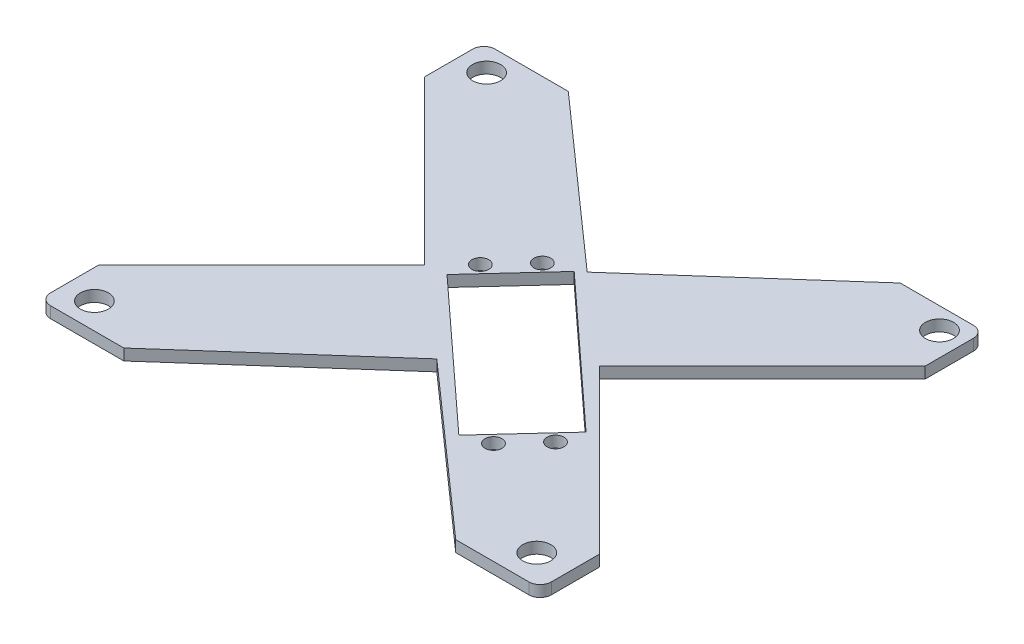
ISO-10303-21;
HEADER;
FILE_DESCRIPTION(('STEP AP214'),'2;1');
FILE_NAME('part.step','',(''),(''),'','','');
FILE_SCHEMA(('AUTOMOTIVE_DESIGN { 1 0 10303 214 1 1 1 1 }'));
ENDSEC;
DATA;
#1=APPLICATION_CONTEXT('core data for automotive mechanical design processes');
#2=APPLICATION_PROTOCOL_DEFINITION('international standard','automotive_design',2000,#1);
#3=PRODUCT_CONTEXT('',#1,'mechanical');
#4=PRODUCT('Part','Part','',(#3));
#5=PRODUCT_RELATED_PRODUCT_CATEGORY('part','',(#4));
#6=PRODUCT_DEFINITION_FORMATION('','',#4);
#7=PRODUCT_DEFINITION_CONTEXT('part definition',#1,'design');
#8=PRODUCT_DEFINITION('design','',#6,#7);
#9=PRODUCT_DEFINITION_SHAPE('','',#8);
#10=(LENGTH_UNIT() NAMED_UNIT(*) SI_UNIT(.MILLI.,.METRE.));
#11=(NAMED_UNIT(*) PLANE_ANGLE_UNIT() SI_UNIT($,.RADIAN.));
#12=(NAMED_UNIT(*) SI_UNIT($,.STERADIAN.) SOLID_ANGLE_UNIT());
#13=UNCERTAINTY_MEASURE_WITH_UNIT(LENGTH_MEASURE(1.E-05),#10,'distance_accuracy_value','');
#14=(GEOMETRIC_REPRESENTATION_CONTEXT(3) GLOBAL_UNCERTAINTY_ASSIGNED_CONTEXT((#13)) GLOBAL_UNIT_ASSIGNED_CONTEXT((#10,
#11,#12)) REPRESENTATION_CONTEXT('',''));
#15=CARTESIAN_POINT('',(0.,0.,0.));
#16=DIRECTION('',(0.,0.,1.));
#17=DIRECTION('',(1.,0.,0.));
#18=AXIS2_PLACEMENT_3D('',#15,#16,#17);
#19=CARTESIAN_POINT('',(56.515,2.54,-50.165));
#20=DIRECTION('',(-1.,0.,0.));
#21=DIRECTION('',(0.,0.,1.));
#22=AXIS2_PLACEMENT_3D('',#19,#20,#21);
#23=PLANE('',#22);
#24=DIRECTION('',(0.,0.,-1.));
#25=VECTOR('',#24,1.);
#26=CARTESIAN_POINT('',(56.515,2.54,-50.165));
#27=LINE('',#26,#25);
#28=CARTESIAN_POINT('',(56.515,2.54,-36.7210512242138));
#29=VERTEX_POINT('',#28);
#30=CARTESIAN_POINT('',(56.515,2.54,-47.625));
#31=VERTEX_POINT('',#30);
#32=EDGE_CURVE('E342',#29,#31,#27,.T.);
#33=ORIENTED_EDGE('',*,*,#32,.F.);
#34=DIRECTION('',(0.,1.,0.));
#35=VECTOR('',#34,1.);
#36=CARTESIAN_POINT('',(56.515,0.,-36.7210512242138));
#37=LINE('',#36,#35);
#38=CARTESIAN_POINT('',(56.515,0.,-36.7210512242138));
#39=VERTEX_POINT('',#38);
#40=EDGE_CURVE('E263',#39,#29,#37,.T.);
#41=ORIENTED_EDGE('',*,*,#40,.F.);
#42=DIRECTION('',(0.,0.,-1.));
#43=VECTOR('',#42,1.);
#44=CARTESIAN_POINT('',(56.515,0.,-50.165));
#45=LINE('',#44,#43);
#46=CARTESIAN_POINT('',(56.515,0.,-47.625));
#47=VERTEX_POINT('',#46);
#48=EDGE_CURVE('E334',#39,#47,#45,.T.);
#49=ORIENTED_EDGE('',*,*,#48,.T.);
#50=DIRECTION('',(0.,-1.,0.));
#51=VECTOR('',#50,1.);
#52=CARTESIAN_POINT('',(56.515,2.54,-47.625));
#53=LINE('',#52,#51);
#54=EDGE_CURVE('E395',#47,#31,#53,.F.);
#55=ORIENTED_EDGE('',*,*,#54,.T.);
#56=EDGE_LOOP('',(#33,#41,#49,#55));
#57=FACE_BOUND('',#56,.T.);
#58=ADVANCED_FACE('F39',(#57),#23,.F.);
#59=CARTESIAN_POINT('',(-56.515,2.54,-50.165));
#60=DIRECTION('',(0.,0.,1.));
#61=DIRECTION('',(1.,0.,0.));
#62=AXIS2_PLACEMENT_3D('',#59,#60,#61);
#63=PLANE('',#62);
#64=DIRECTION('',(-1.,0.,0.));
#65=VECTOR('',#64,1.);
#66=CARTESIAN_POINT('',(-56.515,0.,-50.165));
#67=LINE('',#66,#65);
#68=CARTESIAN_POINT('',(53.975,0.,-50.165));
#69=VERTEX_POINT('',#68);
#70=CARTESIAN_POINT('',(37.461428175192,0.,-50.165));
#71=VERTEX_POINT('',#70);
#72=EDGE_CURVE('E359',#69,#71,#67,.T.);
#73=ORIENTED_EDGE('',*,*,#72,.T.);
#74=DIRECTION('',(0.,1.,0.));
#75=VECTOR('',#74,1.);
#76=CARTESIAN_POINT('',(37.461428175192,0.,-50.165));
#77=LINE('',#76,#75);
#78=CARTESIAN_POINT('',(37.461428175192,2.54,-50.165));
#79=VERTEX_POINT('',#78);
#80=EDGE_CURVE('E331',#71,#79,#77,.T.);
#81=ORIENTED_EDGE('',*,*,#80,.T.);
#82=DIRECTION('',(-1.,0.,0.));
#83=VECTOR('',#82,1.);
#84=CARTESIAN_POINT('',(-56.515,2.54,-50.165));
#85=LINE('',#84,#83);
#86=CARTESIAN_POINT('',(53.975,2.54,-50.165));
#87=VERTEX_POINT('',#86);
#88=EDGE_CURVE('E343',#87,#79,#85,.T.);
#89=ORIENTED_EDGE('',*,*,#88,.F.);
#90=DIRECTION('',(0.,-1.,0.));
#91=VECTOR('',#90,1.);
#92=CARTESIAN_POINT('',(53.975,2.54,-50.165));
#93=LINE('',#92,#91);
#94=EDGE_CURVE('E380',#87,#69,#93,.T.);
#95=ORIENTED_EDGE('',*,*,#94,.T.);
#96=EDGE_LOOP('',(#73,#81,#89,#95));
#97=FACE_BOUND('',#96,.T.);
#98=ADVANCED_FACE('F436',(#97),#63,.F.);
#99=CARTESIAN_POINT('',(-56.515,2.54,-50.165));
#100=DIRECTION('',(1.,0.,0.));
#101=DIRECTION('',(0.,0.,-1.));
#102=AXIS2_PLACEMENT_3D('',#99,#100,#101);
#103=PLANE('',#102);
#104=DIRECTION('',(0.,0.,1.));
#105=VECTOR('',#104,1.);
#106=CARTESIAN_POINT('',(-56.515,0.,-50.165));
#107=LINE('',#106,#105);
#108=CARTESIAN_POINT('',(-56.515,0.,-47.625));
#109=VERTEX_POINT('',#108);
#110=CARTESIAN_POINT('',(-56.515,0.,-36.7210512242138));
#111=VERTEX_POINT('',#110);
#112=EDGE_CURVE('E363',#109,#111,#107,.T.);
#113=ORIENTED_EDGE('',*,*,#112,.T.);
#114=DIRECTION('',(0.,1.,0.));
#115=VECTOR('',#114,1.);
#116=CARTESIAN_POINT('',(-56.515,0.,-36.7210512242138));
#117=LINE('',#116,#115);
#118=CARTESIAN_POINT('',(-56.515,2.54,-36.7210512242138));
#119=VERTEX_POINT('',#118);
#120=EDGE_CURVE('E279',#111,#119,#117,.T.);
#121=ORIENTED_EDGE('',*,*,#120,.T.);
#122=DIRECTION('',(0.,0.,1.));
#123=VECTOR('',#122,1.);
#124=CARTESIAN_POINT('',(-56.515,2.54,-50.165));
#125=LINE('',#124,#123);
#126=CARTESIAN_POINT('',(-56.515,2.54,-47.625));
#127=VERTEX_POINT('',#126);
#128=EDGE_CURVE('E347',#127,#119,#125,.T.);
#129=ORIENTED_EDGE('',*,*,#128,.F.);
#130=DIRECTION('',(0.,-1.,0.));
#131=VECTOR('',#130,1.);
#132=CARTESIAN_POINT('',(-56.515,2.54,-47.625));
#133=LINE('',#132,#131);
#134=EDGE_CURVE('E354',#127,#109,#133,.T.);
#135=ORIENTED_EDGE('',*,*,#134,.T.);
#136=EDGE_LOOP('',(#113,#121,#129,#135));
#137=FACE_BOUND('',#136,.T.);
#138=ADVANCED_FACE('F444',(#137),#103,.F.);
#139=CARTESIAN_POINT('',(-56.515,2.54,50.165));
#140=DIRECTION('',(0.,0.,-1.));
#141=DIRECTION('',(-1.,0.,0.));
#142=AXIS2_PLACEMENT_3D('',#139,#140,#141);
#143=PLANE('',#142);
#144=DIRECTION('',(1.,0.,0.));
#145=VECTOR('',#144,1.);
#146=CARTESIAN_POINT('',(-56.515,0.,50.165));
#147=LINE('',#146,#145);
#148=CARTESIAN_POINT('',(-53.975,0.,50.165));
#149=VERTEX_POINT('',#148);
#150=CARTESIAN_POINT('',(-37.4614281751919,0.,50.165));
#151=VERTEX_POINT('',#150);
#152=EDGE_CURVE('E367',#149,#151,#147,.T.);
#153=ORIENTED_EDGE('',*,*,#152,.T.);
#154=DIRECTION('',(0.,1.,0.));
#155=VECTOR('',#154,1.);
#156=CARTESIAN_POINT('',(-37.4614281751919,0.,50.165));
#157=LINE('',#156,#155);
#158=CARTESIAN_POINT('',(-37.4614281751919,2.54,50.165));
#159=VERTEX_POINT('',#158);
#160=EDGE_CURVE('E302',#151,#159,#157,.T.);
#161=ORIENTED_EDGE('',*,*,#160,.T.);
#162=DIRECTION('',(1.,0.,0.));
#163=VECTOR('',#162,1.);
#164=CARTESIAN_POINT('',(-56.515,2.54,50.165));
#165=LINE('',#164,#163);
#166=CARTESIAN_POINT('',(-53.975,2.54,50.165));
#167=VERTEX_POINT('',#166);
#168=EDGE_CURVE('E351',#167,#159,#165,.T.);
#169=ORIENTED_EDGE('',*,*,#168,.F.);
#170=DIRECTION('',(0.,-1.,0.));
#171=VECTOR('',#170,1.);
#172=CARTESIAN_POINT('',(-53.975,2.54,50.165));
#173=LINE('',#172,#171);
#174=EDGE_CURVE('E404',#167,#149,#173,.T.);
#175=ORIENTED_EDGE('',*,*,#174,.T.);
#176=EDGE_LOOP('',(#153,#161,#169,#175));
#177=FACE_BOUND('',#176,.T.);
#178=ADVANCED_FACE('F451',(#177),#143,.F.);
#179=CARTESIAN_POINT('',(56.515,0.,47.625));
#180=VERTEX_POINT('',#179);
#181=CARTESIAN_POINT('',(56.515,0.,36.7428597041662));
#182=VERTEX_POINT('',#181);
#183=EDGE_CURVE('E355',#180,#182,#45,.T.);
#184=ORIENTED_EDGE('',*,*,#183,.T.);
#185=DIRECTION('',(0.,1.,0.));
#186=VECTOR('',#185,1.);
#187=CARTESIAN_POINT('',(56.515,0.,36.7428597041662));
#188=LINE('',#187,#186);
#189=CARTESIAN_POINT('',(56.515,2.54,36.7428597041662));
#190=VERTEX_POINT('',#189);
#191=EDGE_CURVE('E269',#182,#190,#188,.T.);
#192=ORIENTED_EDGE('',*,*,#191,.T.);
#193=CARTESIAN_POINT('',(56.515,2.54,47.625));
#194=VERTEX_POINT('',#193);
#195=EDGE_CURVE('E338',#194,#190,#27,.T.);
#196=ORIENTED_EDGE('',*,*,#195,.F.);
#197=DIRECTION('',(0.,-1.,0.));
#198=VECTOR('',#197,1.);
#199=CARTESIAN_POINT('',(56.515,2.54,47.625));
#200=LINE('',#199,#198);
#201=EDGE_CURVE('E392',#194,#180,#200,.T.);
#202=ORIENTED_EDGE('',*,*,#201,.T.);
#203=EDGE_LOOP('',(#184,#192,#196,#202));
#204=FACE_BOUND('',#203,.T.);
#205=ADVANCED_FACE('F439',(#204),#23,.F.);
#206=CARTESIAN_POINT('',(-37.4614281751919,2.54,-50.165));
#207=VERTEX_POINT('',#206);
#208=CARTESIAN_POINT('',(-53.975,2.54,-50.165));
#209=VERTEX_POINT('',#208);
#210=EDGE_CURVE('E341',#207,#209,#85,.T.);
#211=ORIENTED_EDGE('',*,*,#210,.F.);
#212=DIRECTION('',(0.,1.,0.));
#213=VECTOR('',#212,1.);
#214=CARTESIAN_POINT('',(-37.4614281751919,0.,-50.165));
#215=LINE('',#214,#213);
#216=CARTESIAN_POINT('',(-37.4614281751919,0.,-50.165));
#217=VERTEX_POINT('',#216);
#218=EDGE_CURVE('E327',#217,#207,#215,.T.);
#219=ORIENTED_EDGE('',*,*,#218,.F.);
#220=CARTESIAN_POINT('',(-53.975,0.,-50.165));
#221=VERTEX_POINT('',#220);
#222=EDGE_CURVE('E358',#217,#221,#67,.T.);
#223=ORIENTED_EDGE('',*,*,#222,.T.);
#224=DIRECTION('',(0.,-1.,0.));
#225=VECTOR('',#224,1.);
#226=CARTESIAN_POINT('',(-53.975,2.54,-50.165));
#227=LINE('',#226,#225);
#228=EDGE_CURVE('E375',#221,#209,#227,.F.);
#229=ORIENTED_EDGE('',*,*,#228,.T.);
#230=EDGE_LOOP('',(#211,#219,#223,#229));
#231=FACE_BOUND('',#230,.T.);
#232=ADVANCED_FACE('F447',(#231),#63,.F.);
#233=CARTESIAN_POINT('',(-56.515,2.54,36.7428597041663));
#234=VERTEX_POINT('',#233);
#235=CARTESIAN_POINT('',(-56.515,2.54,47.625));
#236=VERTEX_POINT('',#235);
#237=EDGE_CURVE('E346',#234,#236,#125,.T.);
#238=ORIENTED_EDGE('',*,*,#237,.F.);
#239=DIRECTION('',(0.,1.,0.));
#240=VECTOR('',#239,1.);
#241=CARTESIAN_POINT('',(-56.515,0.,36.7428597041663));
#242=LINE('',#241,#240);
#243=CARTESIAN_POINT('',(-56.515,0.,36.7428597041663));
#244=VERTEX_POINT('',#243);
#245=EDGE_CURVE('E284',#244,#234,#242,.T.);
#246=ORIENTED_EDGE('',*,*,#245,.F.);
#247=CARTESIAN_POINT('',(-56.515,0.,47.625));
#248=VERTEX_POINT('',#247);
#249=EDGE_CURVE('E362',#244,#248,#107,.T.);
#250=ORIENTED_EDGE('',*,*,#249,.T.);
#251=DIRECTION('',(0.,-1.,0.));
#252=VECTOR('',#251,1.);
#253=CARTESIAN_POINT('',(-56.515,2.54,47.625));
#254=LINE('',#253,#252);
#255=EDGE_CURVE('E11',#248,#236,#254,.F.);
#256=ORIENTED_EDGE('',*,*,#255,.T.);
#257=EDGE_LOOP('',(#238,#246,#250,#256));
#258=FACE_BOUND('',#257,.T.);
#259=ADVANCED_FACE('F457',(#258),#103,.F.);
#260=CARTESIAN_POINT('',(37.461428175192,2.54,50.165));
#261=VERTEX_POINT('',#260);
#262=CARTESIAN_POINT('',(53.975,2.54,50.165));
#263=VERTEX_POINT('',#262);
#264=EDGE_CURVE('E350',#261,#263,#165,.T.);
#265=ORIENTED_EDGE('',*,*,#264,.F.);
#266=DIRECTION('',(0.,1.,0.));
#267=VECTOR('',#266,1.);
#268=CARTESIAN_POINT('',(37.461428175192,0.,50.165));
#269=LINE('',#268,#267);
#270=CARTESIAN_POINT('',(37.461428175192,0.,50.165));
#271=VERTEX_POINT('',#270);
#272=EDGE_CURVE('E306',#271,#261,#269,.T.);
#273=ORIENTED_EDGE('',*,*,#272,.F.);
#274=CARTESIAN_POINT('',(53.975,0.,50.165));
#275=VERTEX_POINT('',#274);
#276=EDGE_CURVE('E366',#271,#275,#147,.T.);
#277=ORIENTED_EDGE('',*,*,#276,.T.);
#278=DIRECTION('',(0.,-1.,0.));
#279=VECTOR('',#278,1.);
#280=CARTESIAN_POINT('',(53.975,2.54,50.165));
#281=LINE('',#280,#279);
#282=EDGE_CURVE('E48',#275,#263,#281,.F.);
#283=ORIENTED_EDGE('',*,*,#282,.T.);
#284=EDGE_LOOP('',(#265,#273,#277,#283));
#285=FACE_BOUND('',#284,.T.);
#286=ADVANCED_FACE('F461',(#285),#143,.F.);
#287=CARTESIAN_POINT('',(0.,2.54,0.));
#288=DIRECTION('',(0.,1.,0.));
#289=DIRECTION('',(0.,0.,1.));
#290=AXIS2_PLACEMENT_3D('',#287,#288,#289);
#291=PLANE('',#290);
#292=CARTESIAN_POINT('',(22.9384426615327,2.54,27.1142567001944));
#293=DIRECTION('',(0.,1.,0.));
#294=DIRECTION('',(0.,0.,1.));
#295=AXIS2_PLACEMENT_3D('',#292,#293,#294);
#296=CIRCLE('',#295,1.905);
#297=CARTESIAN_POINT('',(22.9384426615327,2.54,29.0192567001944));
#298=VERTEX_POINT('',#297);
#299=EDGE_CURVE('E413',#298,#298,#296,.T.);
#300=ORIENTED_EDGE('',*,*,#299,.F.);
#301=EDGE_LOOP('',(#300));
#302=FACE_BOUND('',#301,.T.);
#303=CARTESIAN_POINT('',(29.632724367509,2.54,19.8125152338707));
#304=DIRECTION('',(0.,1.,0.));
#305=DIRECTION('',(0.,0.,-1.));
#306=AXIS2_PLACEMENT_3D('',#303,#304,#305);
#307=CIRCLE('',#306,1.905);
#308=CARTESIAN_POINT('',(29.632724367509,2.54,17.9075152338707));
#309=VERTEX_POINT('',#308);
#310=EDGE_CURVE('E789',#309,#309,#307,.T.);
#311=ORIENTED_EDGE('',*,*,#310,.F.);
#312=EDGE_LOOP('',(#311));
#313=FACE_BOUND('',#312,.T.);
#314=CARTESIAN_POINT('',(-13.5418827123031,2.54,-6.38808292883855));
#315=DIRECTION('',(0.,1.,0.));
#316=DIRECTION('',(0.,0.,-1.));
#317=AXIS2_PLACEMENT_3D('',#314,#315,#316);
#318=CIRCLE('',#317,1.905);
#319=CARTESIAN_POINT('',(-13.5418827123031,2.54,-8.29308292883855));
#320=VERTEX_POINT('',#319);
#321=EDGE_CURVE('E782',#320,#320,#318,.T.);
#322=ORIENTED_EDGE('',*,*,#321,.F.);
#323=EDGE_LOOP('',(#322));
#324=FACE_BOUND('',#323,.T.);
#325=CARTESIAN_POINT('',(-6.83523337993968,2.54,-13.6784663709292));
#326=DIRECTION('',(0.,1.,0.));
#327=DIRECTION('',(0.,0.,1.));
#328=AXIS2_PLACEMENT_3D('',#325,#326,#327);
#329=CIRCLE('',#328,1.90500000000001);
#330=CARTESIAN_POINT('',(-6.83523337993968,2.54,-11.7734663709292));
#331=VERTEX_POINT('',#330);
#332=EDGE_CURVE('E226',#331,#331,#329,.T.);
#333=ORIENTED_EDGE('',*,*,#332,.F.);
#334=EDGE_LOOP('',(#333));
#335=FACE_BOUND('',#334,.T.);
#336=DIRECTION('',(-0.67640499957668,0.,0.736529888427939));
#337=VECTOR('',#336,1.);
#338=CARTESIAN_POINT('',(-1.59845597878194,2.54,-15.6380008972203));
#339=LINE('',#338,#337);
#340=CARTESIAN_POINT('',(-1.59845597878194,2.54,-15.6380008972203));
#341=VERTEX_POINT('',#340);
#342=CARTESIAN_POINT('',(-15.3430055701801,2.54,-0.671713564364595));
#343=VERTEX_POINT('',#342);
#344=EDGE_CURVE('E56',#341,#343,#339,.T.);
#345=ORIENTED_EDGE('',*,*,#344,.F.);
#346=DIRECTION('',(-0.736529888427939,0.,-0.67640499957668));
#347=VECTOR('',#346,1.);
#348=CARTESIAN_POINT('',(31.1402975618399,2.54,14.4282013339631));
#349=LINE('',#348,#347);
#350=CARTESIAN_POINT('',(31.1402975618399,2.54,14.4282013339631));
#351=VERTEX_POINT('',#350);
#352=EDGE_CURVE('E220',#351,#341,#349,.T.);
#353=ORIENTED_EDGE('',*,*,#352,.F.);
#354=DIRECTION('',(0.67640499957668,0.,-0.736529888427939));
#355=VECTOR('',#354,1.);
#356=CARTESIAN_POINT('',(17.3957479704418,2.54,29.3944886668188));
#357=LINE('',#356,#355);
#358=CARTESIAN_POINT('',(17.3957479704418,2.54,29.3944886668188));
#359=VERTEX_POINT('',#358);
#360=EDGE_CURVE('E223',#359,#351,#357,.T.);
#361=ORIENTED_EDGE('',*,*,#360,.F.);
#362=DIRECTION('',(0.736529888427939,0.,0.67640499957668));
#363=VECTOR('',#362,1.);
#364=CARTESIAN_POINT('',(-15.3430055701801,2.54,-0.671713564364596));
#365=LINE('',#364,#363);
#366=EDGE_CURVE('E232',#343,#359,#365,.T.);
#367=ORIENTED_EDGE('',*,*,#366,.F.);
#368=EDGE_LOOP('',(#345,#353,#361,#367));
#369=FACE_BOUND('',#368,.T.);
#370=CARTESIAN_POINT('',(-49.9767571231502,2.54,44.2864859024023));
#371=DIRECTION('',(0.,1.,0.));
#372=DIRECTION('',(0.,0.,1.));
#373=AXIS2_PLACEMENT_3D('',#370,#371,#372);
#374=CIRCLE('',#373,3.175);
#375=CARTESIAN_POINT('',(-49.9767571231502,2.54,47.4614859024023));
#376=VERTEX_POINT('',#375);
#377=EDGE_CURVE('E255',#376,#376,#374,.T.);
#378=ORIENTED_EDGE('',*,*,#377,.F.);
#379=EDGE_LOOP('',(#378));
#380=FACE_BOUND('',#379,.T.);
#381=CARTESIAN_POINT('',(51.1570113978764,2.54,-45.3323583700799));
#382=DIRECTION('',(0.,1.,0.));
#383=DIRECTION('',(0.,0.,1.));
#384=AXIS2_PLACEMENT_3D('',#381,#382,#383);
#385=CIRCLE('',#384,3.175);
#386=CARTESIAN_POINT('',(51.1570113978764,2.54,-42.1573583700799));
#387=VERTEX_POINT('',#386);
#388=EDGE_CURVE('E249',#387,#387,#385,.T.);
#389=ORIENTED_EDGE('',*,*,#388,.F.);
#390=EDGE_LOOP('',(#389));
#391=FACE_BOUND('',#390,.T.);
#392=CARTESIAN_POINT('',(49.165550162761,2.54,43.5676416299201));
#393=DIRECTION('',(0.,1.,0.));
#394=DIRECTION('',(0.,0.,1.));
#395=AXIS2_PLACEMENT_3D('',#392,#393,#394);
#396=CIRCLE('',#395,3.175);
#397=CARTESIAN_POINT('',(49.165550162761,2.54,46.7426416299201));
#398=VERTEX_POINT('',#397);
#399=EDGE_CURVE('E242',#398,#398,#396,.T.);
#400=ORIENTED_EDGE('',*,*,#399,.F.);
#401=EDGE_LOOP('',(#400));
#402=FACE_BOUND('',#401,.T.);
#403=CARTESIAN_POINT('',(-50.3458044374872,2.54,-44.6135140975977));
#404=DIRECTION('',(0.,1.,0.));
#405=DIRECTION('',(0.,0.,1.));
#406=AXIS2_PLACEMENT_3D('',#403,#404,#405);
#407=CIRCLE('',#406,3.175);
#408=CARTESIAN_POINT('',(-50.3458044374872,2.54,-41.4385140975977));
#409=VERTEX_POINT('',#408);
#410=EDGE_CURVE('E245',#409,#409,#407,.T.);
#411=ORIENTED_EDGE('',*,*,#410,.F.);
#412=EDGE_LOOP('',(#411));
#413=FACE_BOUND('',#412,.T.);
#414=DIRECTION('',(-0.707106781186547,0.,-0.707106781186548));
#415=VECTOR('',#414,1.);
#416=CARTESIAN_POINT('',(-56.515,2.54,-36.7210512242138));
#417=LINE('',#416,#415);
#418=CARTESIAN_POINT('',(-19.78304453581,2.54,0.0109042399762238));
#419=VERTEX_POINT('',#418);
#420=EDGE_CURVE('E291',#419,#119,#417,.T.);
#421=ORIENTED_EDGE('',*,*,#420,.F.);
#422=DIRECTION('',(0.707106781186547,0.,-0.707106781186548));
#423=VECTOR('',#422,1.);
#424=CARTESIAN_POINT('',(-19.78304453581,2.54,0.0109042399762238));
#425=LINE('',#424,#423);
#426=EDGE_CURVE('E293',#234,#419,#425,.T.);
#427=ORIENTED_EDGE('',*,*,#426,.F.);
#428=ORIENTED_EDGE('',*,*,#237,.T.);
#429=CARTESIAN_POINT('',(-53.975,2.54,47.625));
#430=DIRECTION('',(0.,1.,0.));
#431=DIRECTION('',(0.,0.,1.));
#432=AXIS2_PLACEMENT_3D('',#429,#430,#431);
#433=CIRCLE('',#432,2.54);
#434=EDGE_CURVE('E398',#236,#167,#433,.T.);
#435=ORIENTED_EDGE('',*,*,#434,.T.);
#436=ORIENTED_EDGE('',*,*,#168,.T.);
#437=DIRECTION('',(-0.748429404128135,0.,0.663214465340138));
#438=VECTOR('',#437,1.);
#439=CARTESIAN_POINT('',(-37.4614281751919,2.54,50.165));
#440=LINE('',#439,#438);
#441=CARTESIAN_POINT('',(0.,2.54,16.9688683126962));
#442=VERTEX_POINT('',#441);
#443=EDGE_CURVE('E312',#442,#159,#440,.T.);
#444=ORIENTED_EDGE('',*,*,#443,.F.);
#445=DIRECTION('',(-0.748429404128135,0.,-0.663214465340138));
#446=VECTOR('',#445,1.);
#447=CARTESIAN_POINT('',(0.,2.54,16.9688683126962));
#448=LINE('',#447,#446);
#449=EDGE_CURVE('E309',#261,#442,#448,.T.);
#450=ORIENTED_EDGE('',*,*,#449,.F.);
#451=ORIENTED_EDGE('',*,*,#264,.T.);
#452=CARTESIAN_POINT('',(53.975,2.54,47.625));
#453=DIRECTION('',(0.,1.,0.));
#454=DIRECTION('',(0.,0.,1.));
#455=AXIS2_PLACEMENT_3D('',#452,#453,#454);
#456=CIRCLE('',#455,2.54);
#457=EDGE_CURVE('E400',#263,#194,#456,.T.);
#458=ORIENTED_EDGE('',*,*,#457,.T.);
#459=ORIENTED_EDGE('',*,*,#195,.T.);
#460=DIRECTION('',(0.707106781186548,0.,0.707106781186547));
#461=VECTOR('',#460,1.);
#462=CARTESIAN_POINT('',(19.78304453581,2.54,0.010904239976219));
#463=LINE('',#462,#461);
#464=CARTESIAN_POINT('',(19.78304453581,2.54,0.010904239976219));
#465=VERTEX_POINT('',#464);
#466=EDGE_CURVE('E273',#465,#190,#463,.T.);
#467=ORIENTED_EDGE('',*,*,#466,.F.);
#468=DIRECTION('',(-0.707106781186547,0.,0.707106781186548));
#469=VECTOR('',#468,1.);
#470=CARTESIAN_POINT('',(56.515,2.54,-36.7210512242138));
#471=LINE('',#470,#469);
#472=EDGE_CURVE('E275',#29,#465,#471,.T.);
#473=ORIENTED_EDGE('',*,*,#472,.F.);
#474=ORIENTED_EDGE('',*,*,#32,.T.);
#475=CARTESIAN_POINT('',(53.975,2.54,-47.625));
#476=DIRECTION('',(0.,1.,0.));
#477=DIRECTION('',(0.,0.,1.));
#478=AXIS2_PLACEMENT_3D('',#475,#476,#477);
#479=CIRCLE('',#478,2.54);
#480=EDGE_CURVE('E402',#31,#87,#479,.T.);
#481=ORIENTED_EDGE('',*,*,#480,.T.);
#482=ORIENTED_EDGE('',*,*,#88,.T.);
#483=DIRECTION('',(0.748429404128135,0.,-0.663214465340138));
#484=VECTOR('',#483,1.);
#485=CARTESIAN_POINT('',(0.,2.54,-16.9688683126962));
#486=LINE('',#485,#484);
#487=CARTESIAN_POINT('',(0.,2.54,-16.9688683126962));
#488=VERTEX_POINT('',#487);
#489=EDGE_CURVE('E324',#488,#79,#486,.T.);
#490=ORIENTED_EDGE('',*,*,#489,.F.);
#491=DIRECTION('',(0.748429404128135,0.,0.663214465340138));
#492=VECTOR('',#491,1.);
#493=CARTESIAN_POINT('',(-37.4614281751919,2.54,-50.165));
#494=LINE('',#493,#492);
#495=EDGE_CURVE('E315',#207,#488,#494,.T.);
#496=ORIENTED_EDGE('',*,*,#495,.F.);
#497=ORIENTED_EDGE('',*,*,#210,.T.);
#498=CARTESIAN_POINT('',(-53.975,2.54,-47.625));
#499=DIRECTION('',(0.,1.,0.));
#500=DIRECTION('',(0.,0.,1.));
#501=AXIS2_PLACEMENT_3D('',#498,#499,#500);
#502=CIRCLE('',#501,2.54);
#503=EDGE_CURVE('E378',#209,#127,#502,.T.);
#504=ORIENTED_EDGE('',*,*,#503,.T.);
#505=ORIENTED_EDGE('',*,*,#128,.T.);
#506=EDGE_LOOP('',(#421,#427,#428,#435,#436,#444,#450,#451,#458,#459,#467,#473,#474,#481,#482,
#490,#496,#497,#504,#505));
#507=FACE_BOUND('',#506,.T.);
#508=ADVANCED_FACE('F476',(#302,#313,#324,#335,#369,#380,#391,#402,#413,#507),#291,.T.);
#509=CARTESIAN_POINT('',(0.,0.,0.));
#510=DIRECTION('',(0.,1.,0.));
#511=DIRECTION('',(0.,0.,1.));
#512=AXIS2_PLACEMENT_3D('',#509,#510,#511);
#513=PLANE('',#512);
#514=CARTESIAN_POINT('',(22.9384426615327,0.,27.1142567001944));
#515=DIRECTION('',(0.,1.,0.));
#516=DIRECTION('',(0.,0.,1.));
#517=AXIS2_PLACEMENT_3D('',#514,#515,#516);
#518=CIRCLE('',#517,1.905);
#519=CARTESIAN_POINT('',(22.9384426615327,0.,29.0192567001944));
#520=VERTEX_POINT('',#519);
#521=EDGE_CURVE('E43',#520,#520,#518,.T.);
#522=ORIENTED_EDGE('',*,*,#521,.T.);
#523=EDGE_LOOP('',(#522));
#524=FACE_BOUND('',#523,.T.);
#525=CARTESIAN_POINT('',(29.632724367509,0.,19.8125152338707));
#526=DIRECTION('',(0.,1.,0.));
#527=DIRECTION('',(0.,0.,1.));
#528=AXIS2_PLACEMENT_3D('',#525,#526,#527);
#529=CIRCLE('',#528,1.905);
#530=CARTESIAN_POINT('',(29.632724367509,0.,21.7175152338707));
#531=VERTEX_POINT('',#530);
#532=EDGE_CURVE('E415',#531,#531,#529,.T.);
#533=ORIENTED_EDGE('',*,*,#532,.T.);
#534=EDGE_LOOP('',(#533));
#535=FACE_BOUND('',#534,.T.);
#536=CARTESIAN_POINT('',(-13.5418827123031,0.,-6.38808292883855));
#537=DIRECTION('',(0.,1.,0.));
#538=DIRECTION('',(0.,0.,1.));
#539=AXIS2_PLACEMENT_3D('',#536,#537,#538);
#540=CIRCLE('',#539,1.905);
#541=CARTESIAN_POINT('',(-13.5418827123031,0.,-4.48308292883855));
#542=VERTEX_POINT('',#541);
#543=EDGE_CURVE('E412',#542,#542,#540,.T.);
#544=ORIENTED_EDGE('',*,*,#543,.T.);
#545=EDGE_LOOP('',(#544));
#546=FACE_BOUND('',#545,.T.);
#547=CARTESIAN_POINT('',(-6.83523337993968,0.,-13.6784663709292));
#548=DIRECTION('',(0.,1.,0.));
#549=DIRECTION('',(0.,0.,1.));
#550=AXIS2_PLACEMENT_3D('',#547,#548,#549);
#551=CIRCLE('',#550,1.90500000000001);
#552=CARTESIAN_POINT('',(-6.83523337993968,0.,-11.7734663709292));
#553=VERTEX_POINT('',#552);
#554=EDGE_CURVE('E409',#553,#553,#551,.T.);
#555=ORIENTED_EDGE('',*,*,#554,.T.);
#556=EDGE_LOOP('',(#555));
#557=FACE_BOUND('',#556,.T.);
#558=DIRECTION('',(-0.736529888427939,0.,-0.67640499957668));
#559=VECTOR('',#558,1.);
#560=CARTESIAN_POINT('',(31.1402975618399,0.,14.4282013339631));
#561=LINE('',#560,#559);
#562=CARTESIAN_POINT('',(31.1402975618399,0.,14.4282013339631));
#563=VERTEX_POINT('',#562);
#564=CARTESIAN_POINT('',(-1.59845597878194,0.,-15.6380008972203));
#565=VERTEX_POINT('',#564);
#566=EDGE_CURVE('E210',#563,#565,#561,.T.);
#567=ORIENTED_EDGE('',*,*,#566,.T.);
#568=DIRECTION('',(-0.67640499957668,0.,0.736529888427939));
#569=VECTOR('',#568,1.);
#570=CARTESIAN_POINT('',(-1.59845597878194,0.,-15.6380008972203));
#571=LINE('',#570,#569);
#572=CARTESIAN_POINT('',(-15.3430055701801,0.,-0.671713564364596));
#573=VERTEX_POINT('',#572);
#574=EDGE_CURVE('E204',#565,#573,#571,.T.);
#575=ORIENTED_EDGE('',*,*,#574,.T.);
#576=DIRECTION('',(0.736529888427939,0.,0.67640499957668));
#577=VECTOR('',#576,1.);
#578=CARTESIAN_POINT('',(-15.3430055701801,0.,-0.671713564364596));
#579=LINE('',#578,#577);
#580=CARTESIAN_POINT('',(17.3957479704418,0.,29.3944886668188));
#581=VERTEX_POINT('',#580);
#582=EDGE_CURVE('E213',#573,#581,#579,.T.);
#583=ORIENTED_EDGE('',*,*,#582,.T.);
#584=DIRECTION('',(0.67640499957668,0.,-0.736529888427939));
#585=VECTOR('',#584,1.);
#586=CARTESIAN_POINT('',(17.3957479704418,0.,29.3944886668188));
#587=LINE('',#586,#585);
#588=EDGE_CURVE('E64',#581,#563,#587,.T.);
#589=ORIENTED_EDGE('',*,*,#588,.T.);
#590=EDGE_LOOP('',(#567,#575,#583,#589));
#591=FACE_BOUND('',#590,.T.);
#592=CARTESIAN_POINT('',(-49.9767571231502,0.,44.2864859024023));
#593=DIRECTION('',(0.,1.,0.));
#594=DIRECTION('',(0.,0.,1.));
#595=AXIS2_PLACEMENT_3D('',#592,#593,#594);
#596=CIRCLE('',#595,3.175);
#597=CARTESIAN_POINT('',(-49.9767571231502,0.,47.4614859024023));
#598=VERTEX_POINT('',#597);
#599=EDGE_CURVE('E238',#598,#598,#596,.T.);
#600=ORIENTED_EDGE('',*,*,#599,.T.);
#601=EDGE_LOOP('',(#600));
#602=FACE_BOUND('',#601,.T.);
#603=CARTESIAN_POINT('',(51.1570113978764,0.,-45.3323583700799));
#604=DIRECTION('',(0.,1.,0.));
#605=DIRECTION('',(0.,0.,1.));
#606=AXIS2_PLACEMENT_3D('',#603,#604,#605);
#607=CIRCLE('',#606,3.175);
#608=CARTESIAN_POINT('',(51.1570113978764,0.,-42.1573583700799));
#609=VERTEX_POINT('',#608);
#610=EDGE_CURVE('E252',#609,#609,#607,.T.);
#611=ORIENTED_EDGE('',*,*,#610,.T.);
#612=EDGE_LOOP('',(#611));
#613=FACE_BOUND('',#612,.T.);
#614=CARTESIAN_POINT('',(49.165550162761,0.,43.5676416299201));
#615=DIRECTION('',(0.,1.,0.));
#616=DIRECTION('',(0.,0.,1.));
#617=AXIS2_PLACEMENT_3D('',#614,#615,#616);
#618=CIRCLE('',#617,3.175);
#619=CARTESIAN_POINT('',(49.165550162761,0.,46.7426416299201));
#620=VERTEX_POINT('',#619);
#621=EDGE_CURVE('E246',#620,#620,#618,.T.);
#622=ORIENTED_EDGE('',*,*,#621,.T.);
#623=EDGE_LOOP('',(#622));
#624=FACE_BOUND('',#623,.T.);
#625=CARTESIAN_POINT('',(-50.3458044374872,0.,-44.6135140975977));
#626=DIRECTION('',(0.,1.,0.));
#627=DIRECTION('',(0.,0.,1.));
#628=AXIS2_PLACEMENT_3D('',#625,#626,#627);
#629=CIRCLE('',#628,3.175);
#630=CARTESIAN_POINT('',(-50.3458044374872,0.,-41.4385140975977));
#631=VERTEX_POINT('',#630);
#632=EDGE_CURVE('E260',#631,#631,#629,.T.);
#633=ORIENTED_EDGE('',*,*,#632,.T.);
#634=EDGE_LOOP('',(#633));
#635=FACE_BOUND('',#634,.T.);
#636=DIRECTION('',(0.707106781186547,0.,-0.707106781186548));
#637=VECTOR('',#636,1.);
#638=CARTESIAN_POINT('',(-19.78304453581,0.,0.0109042399762238));
#639=LINE('',#638,#637);
#640=CARTESIAN_POINT('',(-19.78304453581,0.,0.0109042399762237));
#641=VERTEX_POINT('',#640);
#642=EDGE_CURVE('E294',#244,#641,#639,.T.);
#643=ORIENTED_EDGE('',*,*,#642,.T.);
#644=DIRECTION('',(-0.707106781186547,0.,-0.707106781186548));
#645=VECTOR('',#644,1.);
#646=CARTESIAN_POINT('',(-56.515,0.,-36.7210512242138));
#647=LINE('',#646,#645);
#648=EDGE_CURVE('E286',#641,#111,#647,.T.);
#649=ORIENTED_EDGE('',*,*,#648,.T.);
#650=ORIENTED_EDGE('',*,*,#112,.F.);
#651=CARTESIAN_POINT('',(-53.975,0.,-47.625));
#652=DIRECTION('',(0.,1.,0.));
#653=DIRECTION('',(0.,0.,1.));
#654=AXIS2_PLACEMENT_3D('',#651,#652,#653);
#655=CIRCLE('',#654,2.54);
#656=EDGE_CURVE('E372',#109,#221,#655,.F.);
#657=ORIENTED_EDGE('',*,*,#656,.T.);
#658=ORIENTED_EDGE('',*,*,#222,.F.);
#659=DIRECTION('',(0.748429404128135,0.,0.663214465340138));
#660=VECTOR('',#659,1.);
#661=CARTESIAN_POINT('',(-37.4614281751919,0.,-50.165));
#662=LINE('',#661,#660);
#663=CARTESIAN_POINT('',(0.,0.,-16.9688683126962));
#664=VERTEX_POINT('',#663);
#665=EDGE_CURVE('E320',#217,#664,#662,.T.);
#666=ORIENTED_EDGE('',*,*,#665,.T.);
#667=DIRECTION('',(0.748429404128135,0.,-0.663214465340138));
#668=VECTOR('',#667,1.);
#669=CARTESIAN_POINT('',(0.,0.,-16.9688683126962));
#670=LINE('',#669,#668);
#671=EDGE_CURVE('E323',#664,#71,#670,.T.);
#672=ORIENTED_EDGE('',*,*,#671,.T.);
#673=ORIENTED_EDGE('',*,*,#72,.F.);
#674=CARTESIAN_POINT('',(53.975,0.,-47.625));
#675=DIRECTION('',(0.,1.,0.));
#676=DIRECTION('',(0.,0.,1.));
#677=AXIS2_PLACEMENT_3D('',#674,#675,#676);
#678=CIRCLE('',#677,2.54);
#679=EDGE_CURVE('E389',#69,#47,#678,.F.);
#680=ORIENTED_EDGE('',*,*,#679,.T.);
#681=ORIENTED_EDGE('',*,*,#48,.F.);
#682=DIRECTION('',(-0.707106781186547,0.,0.707106781186548));
#683=VECTOR('',#682,1.);
#684=CARTESIAN_POINT('',(56.515,0.,-36.7210512242138));
#685=LINE('',#684,#683);
#686=CARTESIAN_POINT('',(19.78304453581,0.,0.010904239976219));
#687=VERTEX_POINT('',#686);
#688=EDGE_CURVE('E276',#39,#687,#685,.T.);
#689=ORIENTED_EDGE('',*,*,#688,.T.);
#690=DIRECTION('',(0.707106781186548,0.,0.707106781186547));
#691=VECTOR('',#690,1.);
#692=CARTESIAN_POINT('',(19.78304453581,0.,0.010904239976219));
#693=LINE('',#692,#691);
#694=EDGE_CURVE('E268',#687,#182,#693,.T.);
#695=ORIENTED_EDGE('',*,*,#694,.T.);
#696=ORIENTED_EDGE('',*,*,#183,.F.);
#697=CARTESIAN_POINT('',(53.975,0.,47.625));
#698=DIRECTION('',(0.,1.,0.));
#699=DIRECTION('',(0.,0.,1.));
#700=AXIS2_PLACEMENT_3D('',#697,#698,#699);
#701=CIRCLE('',#700,2.54);
#702=EDGE_CURVE('E386',#180,#275,#701,.F.);
#703=ORIENTED_EDGE('',*,*,#702,.T.);
#704=ORIENTED_EDGE('',*,*,#276,.F.);
#705=DIRECTION('',(-0.748429404128135,0.,-0.663214465340138));
#706=VECTOR('',#705,1.);
#707=CARTESIAN_POINT('',(0.,0.,16.9688683126962));
#708=LINE('',#707,#706);
#709=CARTESIAN_POINT('',(0.,0.,16.9688683126962));
#710=VERTEX_POINT('',#709);
#711=EDGE_CURVE('E305',#271,#710,#708,.T.);
#712=ORIENTED_EDGE('',*,*,#711,.T.);
#713=DIRECTION('',(-0.748429404128135,0.,0.663214465340138));
#714=VECTOR('',#713,1.);
#715=CARTESIAN_POINT('',(-37.4614281751919,0.,50.165));
#716=LINE('',#715,#714);
#717=EDGE_CURVE('E313',#710,#151,#716,.T.);
#718=ORIENTED_EDGE('',*,*,#717,.T.);
#719=ORIENTED_EDGE('',*,*,#152,.F.);
#720=CARTESIAN_POINT('',(-53.975,0.,47.625));
#721=DIRECTION('',(0.,1.,0.));
#722=DIRECTION('',(0.,0.,1.));
#723=AXIS2_PLACEMENT_3D('',#720,#721,#722);
#724=CIRCLE('',#723,2.54);
#725=EDGE_CURVE('E383',#149,#248,#724,.F.);
#726=ORIENTED_EDGE('',*,*,#725,.T.);
#727=ORIENTED_EDGE('',*,*,#249,.F.);
#728=EDGE_LOOP('',(#643,#649,#650,#657,#658,#666,#672,#673,#680,#681,#689,#695,#696,#703,#704,
#712,#718,#719,#726,#727));
#729=FACE_BOUND('',#728,.T.);
#730=ADVANCED_FACE('F217',(#524,#535,#546,#557,#591,#602,#613,#624,#635,#729),#513,.F.);
#731=CARTESIAN_POINT('',(-53.975,2.54,-47.625));
#732=DIRECTION('',(0.,-1.,0.));
#733=DIRECTION('',(0.,0.,-1.));
#734=AXIS2_PLACEMENT_3D('',#731,#732,#733);
#735=CYLINDRICAL_SURFACE('',#734,2.54);
#736=ORIENTED_EDGE('',*,*,#503,.F.);
#737=ORIENTED_EDGE('',*,*,#228,.F.);
#738=ORIENTED_EDGE('',*,*,#656,.F.);
#739=ORIENTED_EDGE('',*,*,#134,.F.);
#740=EDGE_LOOP('',(#736,#737,#738,#739));
#741=FACE_BOUND('',#740,.T.);
#742=ADVANCED_FACE('F514',(#741),#735,.T.);
#743=CARTESIAN_POINT('',(53.975,2.54,-47.625));
#744=DIRECTION('',(0.,-1.,0.));
#745=DIRECTION('',(0.,0.,-1.));
#746=AXIS2_PLACEMENT_3D('',#743,#744,#745);
#747=CYLINDRICAL_SURFACE('',#746,2.54);
#748=ORIENTED_EDGE('',*,*,#480,.F.);
#749=ORIENTED_EDGE('',*,*,#54,.F.);
#750=ORIENTED_EDGE('',*,*,#679,.F.);
#751=ORIENTED_EDGE('',*,*,#94,.F.);
#752=EDGE_LOOP('',(#748,#749,#750,#751));
#753=FACE_BOUND('',#752,.T.);
#754=ADVANCED_FACE('F530',(#753),#747,.T.);
#755=CARTESIAN_POINT('',(53.975,2.54,47.625));
#756=DIRECTION('',(0.,-1.,0.));
#757=DIRECTION('',(0.,0.,-1.));
#758=AXIS2_PLACEMENT_3D('',#755,#756,#757);
#759=CYLINDRICAL_SURFACE('',#758,2.54);
#760=ORIENTED_EDGE('',*,*,#457,.F.);
#761=ORIENTED_EDGE('',*,*,#282,.F.);
#762=ORIENTED_EDGE('',*,*,#702,.F.);
#763=ORIENTED_EDGE('',*,*,#201,.F.);
#764=EDGE_LOOP('',(#760,#761,#762,#763));
#765=FACE_BOUND('',#764,.T.);
#766=ADVANCED_FACE('F479',(#765),#759,.T.);
#767=CARTESIAN_POINT('',(-53.975,2.54,47.625));
#768=DIRECTION('',(0.,-1.,0.));
#769=DIRECTION('',(0.,0.,-1.));
#770=AXIS2_PLACEMENT_3D('',#767,#768,#769);
#771=CYLINDRICAL_SURFACE('',#770,2.54);
#772=ORIENTED_EDGE('',*,*,#434,.F.);
#773=ORIENTED_EDGE('',*,*,#255,.F.);
#774=ORIENTED_EDGE('',*,*,#725,.F.);
#775=ORIENTED_EDGE('',*,*,#174,.F.);
#776=EDGE_LOOP('',(#772,#773,#774,#775));
#777=FACE_BOUND('',#776,.T.);
#778=ADVANCED_FACE('F41',(#777),#771,.T.);
#779=CARTESIAN_POINT('',(0.,0.,-16.9688683126962));
#780=DIRECTION('',(0.663214465340138,0.,0.748429404128135));
#781=DIRECTION('',(0.748429404128135,0.,-0.663214465340138));
#782=AXIS2_PLACEMENT_3D('',#779,#780,#781);
#783=PLANE('',#782);
#784=ORIENTED_EDGE('',*,*,#489,.T.);
#785=ORIENTED_EDGE('',*,*,#80,.F.);
#786=ORIENTED_EDGE('',*,*,#671,.F.);
#787=DIRECTION('',(0.,1.,0.));
#788=VECTOR('',#787,1.);
#789=CARTESIAN_POINT('',(0.,0.,-16.9688683126962));
#790=LINE('',#789,#788);
#791=EDGE_CURVE('E335',#664,#488,#790,.T.);
#792=ORIENTED_EDGE('',*,*,#791,.T.);
#793=EDGE_LOOP('',(#784,#785,#786,#792));
#794=FACE_BOUND('',#793,.T.);
#795=ADVANCED_FACE('F524',(#794),#783,.F.);
#796=CARTESIAN_POINT('',(-37.4614281751919,0.,-50.165));
#797=DIRECTION('',(-0.663214465340138,0.,0.748429404128135));
#798=DIRECTION('',(0.748429404128135,0.,0.663214465340138));
#799=AXIS2_PLACEMENT_3D('',#796,#797,#798);
#800=PLANE('',#799);
#801=ORIENTED_EDGE('',*,*,#495,.T.);
#802=ORIENTED_EDGE('',*,*,#791,.F.);
#803=ORIENTED_EDGE('',*,*,#665,.F.);
#804=ORIENTED_EDGE('',*,*,#218,.T.);
#805=EDGE_LOOP('',(#801,#802,#803,#804));
#806=FACE_BOUND('',#805,.T.);
#807=ADVANCED_FACE('F519',(#806),#800,.F.);
#808=CARTESIAN_POINT('',(56.515,0.,-36.7210512242138));
#809=DIRECTION('',(-0.707106781186548,0.,-0.707106781186547));
#810=DIRECTION('',(-0.707106781186547,0.,0.707106781186548));
#811=AXIS2_PLACEMENT_3D('',#808,#809,#810);
#812=PLANE('',#811);
#813=ORIENTED_EDGE('',*,*,#472,.T.);
#814=DIRECTION('',(0.,1.,0.));
#815=VECTOR('',#814,1.);
#816=CARTESIAN_POINT('',(19.78304453581,0.,0.010904239976219));
#817=LINE('',#816,#815);
#818=EDGE_CURVE('E266',#687,#465,#817,.T.);
#819=ORIENTED_EDGE('',*,*,#818,.F.);
#820=ORIENTED_EDGE('',*,*,#688,.F.);
#821=ORIENTED_EDGE('',*,*,#40,.T.);
#822=EDGE_LOOP('',(#813,#819,#820,#821));
#823=FACE_BOUND('',#822,.T.);
#824=ADVANCED_FACE('F533',(#823),#812,.F.);
#825=CARTESIAN_POINT('',(19.78304453581,0.,0.010904239976219));
#826=DIRECTION('',(-0.707106781186547,0.,0.707106781186548));
#827=DIRECTION('',(0.707106781186548,0.,0.707106781186547));
#828=AXIS2_PLACEMENT_3D('',#825,#826,#827);
#829=PLANE('',#828);
#830=ORIENTED_EDGE('',*,*,#466,.T.);
#831=ORIENTED_EDGE('',*,*,#191,.F.);
#832=ORIENTED_EDGE('',*,*,#694,.F.);
#833=ORIENTED_EDGE('',*,*,#818,.T.);
#834=EDGE_LOOP('',(#830,#831,#832,#833));
#835=FACE_BOUND('',#834,.T.);
#836=ADVANCED_FACE('F471',(#835),#829,.F.);
#837=CARTESIAN_POINT('',(-37.4614281751919,0.,50.165));
#838=DIRECTION('',(-0.663214465340138,0.,-0.748429404128135));
#839=DIRECTION('',(-0.748429404128135,0.,0.663214465340138));
#840=AXIS2_PLACEMENT_3D('',#837,#838,#839);
#841=PLANE('',#840);
#842=ORIENTED_EDGE('',*,*,#443,.T.);
#843=ORIENTED_EDGE('',*,*,#160,.F.);
#844=ORIENTED_EDGE('',*,*,#717,.F.);
#845=DIRECTION('',(0.,1.,0.));
#846=VECTOR('',#845,1.);
#847=CARTESIAN_POINT('',(0.,0.,16.9688683126962));
#848=LINE('',#847,#846);
#849=EDGE_CURVE('E297',#710,#442,#848,.T.);
#850=ORIENTED_EDGE('',*,*,#849,.T.);
#851=EDGE_LOOP('',(#842,#843,#844,#850));
#852=FACE_BOUND('',#851,.T.);
#853=ADVANCED_FACE('F490',(#852),#841,.F.);
#854=CARTESIAN_POINT('',(0.,0.,16.9688683126962));
#855=DIRECTION('',(0.663214465340138,0.,-0.748429404128135));
#856=DIRECTION('',(-0.748429404128135,0.,-0.663214465340138));
#857=AXIS2_PLACEMENT_3D('',#854,#855,#856);
#858=PLANE('',#857);
#859=ORIENTED_EDGE('',*,*,#449,.T.);
#860=ORIENTED_EDGE('',*,*,#849,.F.);
#861=ORIENTED_EDGE('',*,*,#711,.F.);
#862=ORIENTED_EDGE('',*,*,#272,.T.);
#863=EDGE_LOOP('',(#859,#860,#861,#862));
#864=FACE_BOUND('',#863,.T.);
#865=ADVANCED_FACE('F486',(#864),#858,.F.);
#866=CARTESIAN_POINT('',(-56.515,0.,-36.7210512242138));
#867=DIRECTION('',(0.707106781186548,0.,-0.707106781186547));
#868=DIRECTION('',(-0.707106781186547,0.,-0.707106781186548));
#869=AXIS2_PLACEMENT_3D('',#866,#867,#868);
#870=PLANE('',#869);
#871=ORIENTED_EDGE('',*,*,#420,.T.);
#872=ORIENTED_EDGE('',*,*,#120,.F.);
#873=ORIENTED_EDGE('',*,*,#648,.F.);
#874=DIRECTION('',(0.,1.,0.));
#875=VECTOR('',#874,1.);
#876=CARTESIAN_POINT('',(-19.78304453581,0.,0.0109042399762238));
#877=LINE('',#876,#875);
#878=EDGE_CURVE('E287',#641,#419,#877,.T.);
#879=ORIENTED_EDGE('',*,*,#878,.T.);
#880=EDGE_LOOP('',(#871,#872,#873,#879));
#881=FACE_BOUND('',#880,.T.);
#882=ADVANCED_FACE('F506',(#881),#870,.F.);
#883=CARTESIAN_POINT('',(-19.78304453581,0.,0.0109042399762238));
#884=DIRECTION('',(0.707106781186548,0.,0.707106781186547));
#885=DIRECTION('',(0.707106781186547,0.,-0.707106781186548));
#886=AXIS2_PLACEMENT_3D('',#883,#884,#885);
#887=PLANE('',#886);
#888=ORIENTED_EDGE('',*,*,#426,.T.);
#889=ORIENTED_EDGE('',*,*,#878,.F.);
#890=ORIENTED_EDGE('',*,*,#642,.F.);
#891=ORIENTED_EDGE('',*,*,#245,.T.);
#892=EDGE_LOOP('',(#888,#889,#890,#891));
#893=FACE_BOUND('',#892,.T.);
#894=ADVANCED_FACE('F502',(#893),#887,.F.);
#895=CARTESIAN_POINT('',(-50.3458044374872,0.,-44.6135140975977));
#896=DIRECTION('',(0.,1.,0.));
#897=DIRECTION('',(0.,0.,1.));
#898=AXIS2_PLACEMENT_3D('',#895,#896,#897);
#899=CYLINDRICAL_SURFACE('',#898,3.175);
#900=ORIENTED_EDGE('',*,*,#632,.F.);
#901=EDGE_LOOP('',(#900));
#902=FACE_BOUND('',#901,.T.);
#903=ORIENTED_EDGE('',*,*,#410,.T.);
#904=EDGE_LOOP('',(#903));
#905=FACE_BOUND('',#904,.T.);
#906=ADVANCED_FACE('F543',(#902,#905),#899,.F.);
#907=CARTESIAN_POINT('',(49.165550162761,0.,43.5676416299201));
#908=DIRECTION('',(0.,1.,0.));
#909=DIRECTION('',(0.,0.,1.));
#910=AXIS2_PLACEMENT_3D('',#907,#908,#909);
#911=CYLINDRICAL_SURFACE('',#910,3.175);
#912=ORIENTED_EDGE('',*,*,#621,.F.);
#913=EDGE_LOOP('',(#912));
#914=FACE_BOUND('',#913,.T.);
#915=ORIENTED_EDGE('',*,*,#399,.T.);
#916=EDGE_LOOP('',(#915));
#917=FACE_BOUND('',#916,.T.);
#918=ADVANCED_FACE('F684',(#914,#917),#911,.F.);
#919=CARTESIAN_POINT('',(51.1570113978764,0.,-45.3323583700799));
#920=DIRECTION('',(0.,1.,0.));
#921=DIRECTION('',(0.,0.,1.));
#922=AXIS2_PLACEMENT_3D('',#919,#920,#921);
#923=CYLINDRICAL_SURFACE('',#922,3.175);
#924=ORIENTED_EDGE('',*,*,#610,.F.);
#925=EDGE_LOOP('',(#924));
#926=FACE_BOUND('',#925,.T.);
#927=ORIENTED_EDGE('',*,*,#388,.T.);
#928=EDGE_LOOP('',(#927));
#929=FACE_BOUND('',#928,.T.);
#930=ADVANCED_FACE('F693',(#926,#929),#923,.F.);
#931=CARTESIAN_POINT('',(-49.9767571231502,0.,44.2864859024023));
#932=DIRECTION('',(0.,1.,0.));
#933=DIRECTION('',(0.,0.,1.));
#934=AXIS2_PLACEMENT_3D('',#931,#932,#933);
#935=CYLINDRICAL_SURFACE('',#934,3.175);
#936=ORIENTED_EDGE('',*,*,#599,.F.);
#937=EDGE_LOOP('',(#936));
#938=FACE_BOUND('',#937,.T.);
#939=ORIENTED_EDGE('',*,*,#377,.T.);
#940=EDGE_LOOP('',(#939));
#941=FACE_BOUND('',#940,.T.);
#942=ADVANCED_FACE('F703',(#938,#941),#935,.F.);
#943=CARTESIAN_POINT('',(-1.59845597878194,0.,-15.6380008972203));
#944=DIRECTION('',(-0.736529888427939,0.,-0.67640499957668));
#945=DIRECTION('',(-0.67640499957668,0.,0.736529888427939));
#946=AXIS2_PLACEMENT_3D('',#943,#944,#945);
#947=PLANE('',#946);
#948=ORIENTED_EDGE('',*,*,#344,.T.);
#949=DIRECTION('',(0.,1.,0.));
#950=VECTOR('',#949,1.);
#951=CARTESIAN_POINT('',(-15.3430055701801,0.,-0.671713564364596));
#952=LINE('',#951,#950);
#953=EDGE_CURVE('E200',#573,#343,#952,.T.);
#954=ORIENTED_EDGE('',*,*,#953,.F.);
#955=ORIENTED_EDGE('',*,*,#574,.F.);
#956=DIRECTION('',(0.,1.,0.));
#957=VECTOR('',#956,1.);
#958=CARTESIAN_POINT('',(-1.59845597878194,0.,-15.6380008972203));
#959=LINE('',#958,#957);
#960=EDGE_CURVE('E236',#565,#341,#959,.T.);
#961=ORIENTED_EDGE('',*,*,#960,.T.);
#962=EDGE_LOOP('',(#948,#954,#955,#961));
#963=FACE_BOUND('',#962,.T.);
#964=ADVANCED_FACE('F202',(#963),#947,.F.);
#965=CARTESIAN_POINT('',(31.1402975618399,0.,14.4282013339631));
#966=DIRECTION('',(0.67640499957668,0.,-0.736529888427939));
#967=DIRECTION('',(-0.736529888427939,0.,-0.67640499957668));
#968=AXIS2_PLACEMENT_3D('',#965,#966,#967);
#969=PLANE('',#968);
#970=ORIENTED_EDGE('',*,*,#352,.T.);
#971=ORIENTED_EDGE('',*,*,#960,.F.);
#972=ORIENTED_EDGE('',*,*,#566,.F.);
#973=DIRECTION('',(0.,1.,0.));
#974=VECTOR('',#973,1.);
#975=CARTESIAN_POINT('',(31.1402975618399,0.,14.4282013339631));
#976=LINE('',#975,#974);
#977=EDGE_CURVE('E239',#563,#351,#976,.T.);
#978=ORIENTED_EDGE('',*,*,#977,.T.);
#979=EDGE_LOOP('',(#970,#971,#972,#978));
#980=FACE_BOUND('',#979,.T.);
#981=ADVANCED_FACE('F721',(#980),#969,.F.);
#982=CARTESIAN_POINT('',(17.3957479704418,0.,29.3944886668188));
#983=DIRECTION('',(0.736529888427939,0.,0.67640499957668));
#984=DIRECTION('',(0.67640499957668,0.,-0.736529888427939));
#985=AXIS2_PLACEMENT_3D('',#982,#983,#984);
#986=PLANE('',#985);
#987=ORIENTED_EDGE('',*,*,#360,.T.);
#988=ORIENTED_EDGE('',*,*,#977,.F.);
#989=ORIENTED_EDGE('',*,*,#588,.F.);
#990=DIRECTION('',(0.,1.,0.));
#991=VECTOR('',#990,1.);
#992=CARTESIAN_POINT('',(17.3957479704418,0.,29.3944886668188));
#993=LINE('',#992,#991);
#994=EDGE_CURVE('E209',#581,#359,#993,.T.);
#995=ORIENTED_EDGE('',*,*,#994,.T.);
#996=EDGE_LOOP('',(#987,#988,#989,#995));
#997=FACE_BOUND('',#996,.T.);
#998=ADVANCED_FACE('F730',(#997),#986,.F.);
#999=CARTESIAN_POINT('',(-15.3430055701801,0.,-0.671713564364596));
#1000=DIRECTION('',(-0.67640499957668,0.,0.736529888427939));
#1001=DIRECTION('',(0.736529888427939,0.,0.67640499957668));
#1002=AXIS2_PLACEMENT_3D('',#999,#1000,#1001);
#1003=PLANE('',#1002);
#1004=ORIENTED_EDGE('',*,*,#366,.T.);
#1005=ORIENTED_EDGE('',*,*,#994,.F.);
#1006=ORIENTED_EDGE('',*,*,#582,.F.);
#1007=ORIENTED_EDGE('',*,*,#953,.T.);
#1008=EDGE_LOOP('',(#1004,#1005,#1006,#1007));
#1009=FACE_BOUND('',#1008,.T.);
#1010=ADVANCED_FACE('F214',(#1009),#1003,.F.);
#1011=CARTESIAN_POINT('',(-6.83523337993968,-2.54,-13.6784663709292));
#1012=DIRECTION('',(0.,1.,0.));
#1013=DIRECTION('',(0.,0.,1.));
#1014=AXIS2_PLACEMENT_3D('',#1011,#1012,#1013);
#1015=CYLINDRICAL_SURFACE('',#1014,1.90500000000001);
#1016=ORIENTED_EDGE('',*,*,#332,.T.);
#1017=EDGE_LOOP('',(#1016));
#1018=FACE_BOUND('',#1017,.T.);
#1019=ORIENTED_EDGE('',*,*,#554,.F.);
#1020=EDGE_LOOP('',(#1019));
#1021=FACE_BOUND('',#1020,.T.);
#1022=ADVANCED_FACE('F748',(#1018,#1021),#1015,.F.);
#1023=CARTESIAN_POINT('',(-13.5418827123031,-2.54,-6.38808292883855));
#1024=DIRECTION('',(0.,1.,0.));
#1025=DIRECTION('',(0.,0.,1.));
#1026=AXIS2_PLACEMENT_3D('',#1023,#1024,#1025);
#1027=CYLINDRICAL_SURFACE('',#1026,1.905);
#1028=ORIENTED_EDGE('',*,*,#321,.T.);
#1029=EDGE_LOOP('',(#1028));
#1030=FACE_BOUND('',#1029,.T.);
#1031=ORIENTED_EDGE('',*,*,#543,.F.);
#1032=EDGE_LOOP('',(#1031));
#1033=FACE_BOUND('',#1032,.T.);
#1034=ADVANCED_FACE('F431',(#1030,#1033),#1027,.F.);
#1035=CARTESIAN_POINT('',(29.632724367509,-2.54,19.8125152338707));
#1036=DIRECTION('',(0.,1.,0.));
#1037=DIRECTION('',(0.,0.,1.));
#1038=AXIS2_PLACEMENT_3D('',#1035,#1036,#1037);
#1039=CYLINDRICAL_SURFACE('',#1038,1.905);
#1040=ORIENTED_EDGE('',*,*,#310,.T.);
#1041=EDGE_LOOP('',(#1040));
#1042=FACE_BOUND('',#1041,.T.);
#1043=ORIENTED_EDGE('',*,*,#532,.F.);
#1044=EDGE_LOOP('',(#1043));
#1045=FACE_BOUND('',#1044,.T.);
#1046=ADVANCED_FACE('F425',(#1042,#1045),#1039,.F.);
#1047=CARTESIAN_POINT('',(22.9384426615327,-2.54,27.1142567001944));
#1048=DIRECTION('',(0.,1.,0.));
#1049=DIRECTION('',(0.,0.,1.));
#1050=AXIS2_PLACEMENT_3D('',#1047,#1048,#1049);
#1051=CYLINDRICAL_SURFACE('',#1050,1.905);
#1052=ORIENTED_EDGE('',*,*,#299,.T.);
#1053=EDGE_LOOP('',(#1052));
#1054=FACE_BOUND('',#1053,.T.);
#1055=ORIENTED_EDGE('',*,*,#521,.F.);
#1056=EDGE_LOOP('',(#1055));
#1057=FACE_BOUND('',#1056,.T.);
#1058=ADVANCED_FACE('F423',(#1054,#1057),#1051,.F.);
#1059=CLOSED_SHELL('',(#58,#98,#138,#178,#205,#232,#259,#286,#508,#730,#742,#754,#766,#778,#795,
#807,#824,#836,#853,#865,#882,#894,#906,#918,#930,#942,#964,#981,#998,#1010,#1022,#1034,#1046,#1058));
#1060=MANIFOLD_SOLID_BREP('B2',#1059);
#1061=ADVANCED_BREP_SHAPE_REPRESENTATION('',(#18,#1060),#14);
#1062=SHAPE_DEFINITION_REPRESENTATION(#9,#1061);
ENDSEC;
END-ISO-10303-21;
